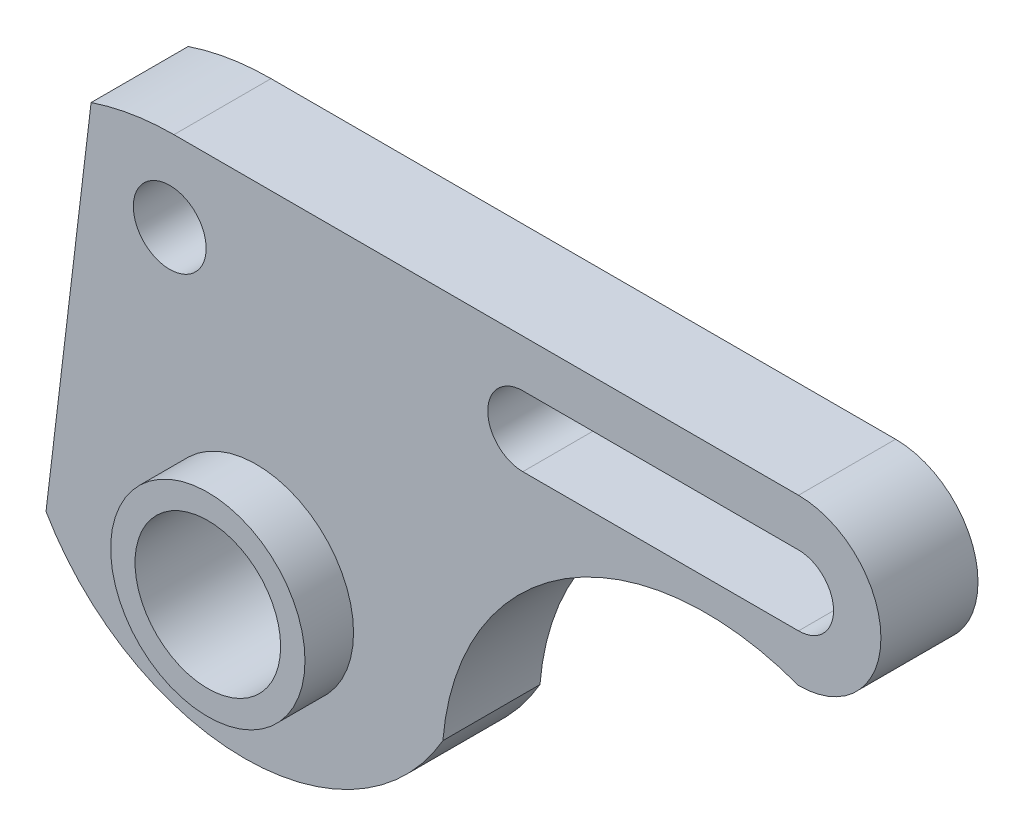
ISO-10303-21;
HEADER;
FILE_DESCRIPTION(('STEP AP214'),'2;1');
FILE_NAME('part.step','',(''),(''),'','','');
FILE_SCHEMA(('AUTOMOTIVE_DESIGN { 1 0 10303 214 1 1 1 1 }'));
ENDSEC;
DATA;
#1=APPLICATION_CONTEXT('core data for automotive mechanical design processes');
#2=APPLICATION_PROTOCOL_DEFINITION('international standard','automotive_design',2000,#1);
#3=PRODUCT_CONTEXT('',#1,'mechanical');
#4=PRODUCT('Part','Part','',(#3));
#5=PRODUCT_RELATED_PRODUCT_CATEGORY('part','',(#4));
#6=PRODUCT_DEFINITION_FORMATION('','',#4);
#7=PRODUCT_DEFINITION_CONTEXT('part definition',#1,'design');
#8=PRODUCT_DEFINITION('design','',#6,#7);
#9=PRODUCT_DEFINITION_SHAPE('','',#8);
#10=(LENGTH_UNIT() NAMED_UNIT(*) SI_UNIT(.MILLI.,.METRE.));
#11=(NAMED_UNIT(*) PLANE_ANGLE_UNIT() SI_UNIT($,.RADIAN.));
#12=(NAMED_UNIT(*) SI_UNIT($,.STERADIAN.) SOLID_ANGLE_UNIT());
#13=UNCERTAINTY_MEASURE_WITH_UNIT(LENGTH_MEASURE(1.E-05),#10,'distance_accuracy_value','');
#14=(GEOMETRIC_REPRESENTATION_CONTEXT(3) GLOBAL_UNCERTAINTY_ASSIGNED_CONTEXT((#13)) GLOBAL_UNIT_ASSIGNED_CONTEXT((#10,
#11,#12)) REPRESENTATION_CONTEXT('',''));
#15=CARTESIAN_POINT('',(0.,0.,0.));
#16=DIRECTION('',(0.,0.,1.));
#17=DIRECTION('',(1.,0.,0.));
#18=AXIS2_PLACEMENT_3D('',#15,#16,#17);
#19=CARTESIAN_POINT('',(-2.45741540152947,-1.40611469499279,20.));
#20=DIRECTION('',(0.,0.,-1.));
#21=DIRECTION('',(-1.,0.,0.));
#22=AXIS2_PLACEMENT_3D('',#19,#20,#21);
#23=CYLINDRICAL_SURFACE('',#22,47.2126677429411);
#24=CARTESIAN_POINT('',(-2.45741540152947,-1.40611469499279,0.));
#25=DIRECTION('',(0.,0.,1.));
#26=DIRECTION('',(1.,0.,0.));
#27=AXIS2_PLACEMENT_3D('',#24,#25,#26);
#28=CIRCLE('',#27,47.2126677429411);
#29=CARTESIAN_POINT('',(-43.3398716269745,-25.0209568155729,0.));
#30=VERTEX_POINT('',#29);
#31=CARTESIAN_POINT('',(38.4250408239156,-25.0209568155729,0.));
#32=VERTEX_POINT('',#31);
#33=EDGE_CURVE('E163',#30,#32,#28,.T.);
#34=ORIENTED_EDGE('',*,*,#33,.T.);
#35=DIRECTION('',(0.,0.,-1.));
#36=VECTOR('',#35,1.);
#37=CARTESIAN_POINT('',(38.4250408239156,-25.0209568155729,20.));
#38=LINE('',#37,#36);
#39=CARTESIAN_POINT('',(38.4250408239156,-25.0209568155729,20.));
#40=VERTEX_POINT('',#39);
#41=EDGE_CURVE('E11',#40,#32,#38,.T.);
#42=ORIENTED_EDGE('',*,*,#41,.F.);
#43=CARTESIAN_POINT('',(-2.45741540152947,-1.40611469499279,20.));
#44=DIRECTION('',(0.,0.,1.));
#45=DIRECTION('',(1.,0.,0.));
#46=AXIS2_PLACEMENT_3D('',#43,#44,#45);
#47=CIRCLE('',#46,47.2126677429411);
#48=CARTESIAN_POINT('',(-43.3398716269745,-25.0209568155729,20.));
#49=VERTEX_POINT('',#48);
#50=EDGE_CURVE('E177',#49,#40,#47,.T.);
#51=ORIENTED_EDGE('',*,*,#50,.F.);
#52=DIRECTION('',(0.,0.,-1.));
#53=VECTOR('',#52,1.);
#54=CARTESIAN_POINT('',(-43.3398716269745,-25.0209568155729,20.));
#55=LINE('',#54,#53);
#56=EDGE_CURVE('E197',#49,#30,#55,.T.);
#57=ORIENTED_EDGE('',*,*,#56,.T.);
#58=EDGE_LOOP('',(#34,#42,#51,#57));
#59=FACE_BOUND('',#58,.T.);
#60=ADVANCED_FACE('F39',(#59),#23,.T.);
#61=CARTESIAN_POINT('',(92.6692282730483,-29.5510831580167,20.));
#62=DIRECTION('',(0.,0.,-1.));
#63=DIRECTION('',(-1.,0.,0.));
#64=AXIS2_PLACEMENT_3D('',#61,#62,#63);
#65=CYLINDRICAL_SURFACE('',#64,54.4330222998425);
#66=CARTESIAN_POINT('',(92.6692282730483,-29.5510831580167,0.));
#67=DIRECTION('',(0.,0.,-1.));
#68=DIRECTION('',(-1.,0.,0.));
#69=AXIS2_PLACEMENT_3D('',#66,#67,#68);
#70=CIRCLE('',#69,54.4330222998425);
#71=CARTESIAN_POINT('',(111.700700069522,21.4465344133482,0.));
#72=VERTEX_POINT('',#71);
#73=EDGE_CURVE('E201',#32,#72,#70,.T.);
#74=ORIENTED_EDGE('',*,*,#73,.T.);
#75=DIRECTION('',(0.,0.,-1.));
#76=VECTOR('',#75,1.);
#77=CARTESIAN_POINT('',(111.700700069522,21.4465344133482,20.));
#78=LINE('',#77,#76);
#79=CARTESIAN_POINT('',(111.700700069522,21.4465344133482,20.));
#80=VERTEX_POINT('',#79);
#81=EDGE_CURVE('E47',#80,#72,#78,.T.);
#82=ORIENTED_EDGE('',*,*,#81,.F.);
#83=CARTESIAN_POINT('',(92.6692282730483,-29.5510831580167,20.));
#84=DIRECTION('',(0.,0.,-1.));
#85=DIRECTION('',(-1.,0.,0.));
#86=AXIS2_PLACEMENT_3D('',#83,#84,#85);
#87=CIRCLE('',#86,54.4330222998425);
#88=EDGE_CURVE('E181',#40,#80,#87,.T.);
#89=ORIENTED_EDGE('',*,*,#88,.F.);
#90=ORIENTED_EDGE('',*,*,#41,.T.);
#91=EDGE_LOOP('',(#74,#82,#89,#90));
#92=FACE_BOUND('',#91,.T.);
#93=ADVANCED_FACE('F257',(#92),#65,.F.);
#94=CARTESIAN_POINT('',(111.700700069522,38.4250408239155,20.));
#95=DIRECTION('',(0.,0.,-1.));
#96=DIRECTION('',(-1.,0.,0.));
#97=AXIS2_PLACEMENT_3D('',#94,#95,#96);
#98=CYLINDRICAL_SURFACE('',#97,16.9785064105673);
#99=CARTESIAN_POINT('',(111.700700069522,38.4250408239155,0.));
#100=DIRECTION('',(0.,0.,1.));
#101=DIRECTION('',(1.,0.,0.));
#102=AXIS2_PLACEMENT_3D('',#99,#100,#101);
#103=CIRCLE('',#102,16.9785064105673);
#104=CARTESIAN_POINT('',(111.700700069522,55.4035472344829,0.));
#105=VERTEX_POINT('',#104);
#106=EDGE_CURVE('E204',#72,#105,#103,.T.);
#107=ORIENTED_EDGE('',*,*,#106,.T.);
#108=DIRECTION('',(0.,0.,-1.));
#109=VECTOR('',#108,1.);
#110=CARTESIAN_POINT('',(111.700700069522,55.4035472344829,20.));
#111=LINE('',#110,#109);
#112=CARTESIAN_POINT('',(111.700700069522,55.4035472344829,20.));
#113=VERTEX_POINT('',#112);
#114=EDGE_CURVE('E226',#113,#105,#111,.T.);
#115=ORIENTED_EDGE('',*,*,#114,.F.);
#116=CARTESIAN_POINT('',(111.700700069522,38.4250408239155,20.));
#117=DIRECTION('',(0.,0.,1.));
#118=DIRECTION('',(1.,0.,0.));
#119=AXIS2_PLACEMENT_3D('',#116,#117,#118);
#120=CIRCLE('',#119,16.9785064105673);
#121=EDGE_CURVE('E185',#80,#113,#120,.T.);
#122=ORIENTED_EDGE('',*,*,#121,.F.);
#123=ORIENTED_EDGE('',*,*,#81,.T.);
#124=EDGE_LOOP('',(#107,#115,#122,#123));
#125=FACE_BOUND('',#124,.T.);
#126=ADVANCED_FACE('F235',(#125),#98,.T.);
#127=CARTESIAN_POINT('',(111.700700069522,55.4035472344829,20.));
#128=DIRECTION('',(0.,-1.,0.));
#129=DIRECTION('',(0.,0.,-1.));
#130=AXIS2_PLACEMENT_3D('',#127,#128,#129);
#131=PLANE('',#130);
#132=DIRECTION('',(-1.,0.,0.));
#133=VECTOR('',#132,1.);
#134=CARTESIAN_POINT('',(111.700700069522,55.4035472344829,0.));
#135=LINE('',#134,#133);
#136=CARTESIAN_POINT('',(-16.9785064105673,55.4035472344829,0.));
#137=VERTEX_POINT('',#136);
#138=EDGE_CURVE('E207',#105,#137,#135,.T.);
#139=ORIENTED_EDGE('',*,*,#138,.T.);
#140=DIRECTION('',(0.,0.,-1.));
#141=VECTOR('',#140,1.);
#142=CARTESIAN_POINT('',(-16.9785064105673,55.4035472344829,20.));
#143=LINE('',#142,#141);
#144=CARTESIAN_POINT('',(-16.9785064105673,55.4035472344829,20.));
#145=VERTEX_POINT('',#144);
#146=EDGE_CURVE('E222',#145,#137,#143,.T.);
#147=ORIENTED_EDGE('',*,*,#146,.F.);
#148=DIRECTION('',(-1.,0.,0.));
#149=VECTOR('',#148,1.);
#150=CARTESIAN_POINT('',(111.700700069522,55.4035472344829,20.));
#151=LINE('',#150,#149);
#152=EDGE_CURVE('E188',#113,#145,#151,.T.);
#153=ORIENTED_EDGE('',*,*,#152,.F.);
#154=ORIENTED_EDGE('',*,*,#114,.T.);
#155=EDGE_LOOP('',(#139,#147,#153,#154));
#156=FACE_BOUND('',#155,.T.);
#157=ADVANCED_FACE('F245',(#156),#131,.F.);
#158=CARTESIAN_POINT('',(-16.9785064105673,2.00057949585947,20.));
#159=DIRECTION('',(0.,0.,-1.));
#160=DIRECTION('',(-1.,0.,0.));
#161=AXIS2_PLACEMENT_3D('',#158,#159,#160);
#162=CYLINDRICAL_SURFACE('',#161,53.4029677386234);
#163=CARTESIAN_POINT('',(-16.9785064105673,2.00057949585947,0.));
#164=DIRECTION('',(0.,0.,1.));
#165=DIRECTION('',(1.,0.,0.));
#166=AXIS2_PLACEMENT_3D('',#163,#164,#165);
#167=CIRCLE('',#166,53.4029677386234);
#168=CARTESIAN_POINT('',(-34.0483396348929,52.6019407125912,0.));
#169=VERTEX_POINT('',#168);
#170=EDGE_CURVE('E210',#137,#169,#167,.T.);
#171=ORIENTED_EDGE('',*,*,#170,.T.);
#172=DIRECTION('',(0.,0.,-1.));
#173=VECTOR('',#172,1.);
#174=CARTESIAN_POINT('',(-34.0483396348929,52.6019407125912,20.));
#175=LINE('',#174,#173);
#176=CARTESIAN_POINT('',(-34.0483396348929,52.6019407125912,20.));
#177=VERTEX_POINT('',#176);
#178=EDGE_CURVE('E218',#177,#169,#175,.T.);
#179=ORIENTED_EDGE('',*,*,#178,.F.);
#180=CARTESIAN_POINT('',(-16.9785064105673,2.00057949585947,20.));
#181=DIRECTION('',(0.,0.,1.));
#182=DIRECTION('',(1.,0.,0.));
#183=AXIS2_PLACEMENT_3D('',#180,#181,#182);
#184=CIRCLE('',#183,53.4029677386234);
#185=EDGE_CURVE('E191',#145,#177,#184,.T.);
#186=ORIENTED_EDGE('',*,*,#185,.F.);
#187=ORIENTED_EDGE('',*,*,#146,.T.);
#188=EDGE_LOOP('',(#171,#179,#186,#187));
#189=FACE_BOUND('',#188,.T.);
#190=ADVANCED_FACE('F249',(#189),#162,.T.);
#191=CARTESIAN_POINT('',(-34.0483396348929,52.6019407125912,20.));
#192=DIRECTION('',(0.992911925064084,-0.118852467645966,0.));
#193=DIRECTION('',(0.118852467645966,0.992911925064084,0.));
#194=AXIS2_PLACEMENT_3D('',#191,#192,#193);
#195=PLANE('',#194);
#196=DIRECTION('',(-0.118852467645966,-0.992911925064084,0.));
#197=VECTOR('',#196,1.);
#198=CARTESIAN_POINT('',(-34.0483396348929,52.6019407125912,0.));
#199=LINE('',#198,#197);
#200=EDGE_CURVE('E182',#169,#30,#199,.T.);
#201=ORIENTED_EDGE('',*,*,#200,.T.);
#202=ORIENTED_EDGE('',*,*,#56,.F.);
#203=DIRECTION('',(-0.118852467645966,-0.992911925064084,0.));
#204=VECTOR('',#203,1.);
#205=CARTESIAN_POINT('',(-34.0483396348929,52.6019407125912,20.));
#206=LINE('',#205,#204);
#207=EDGE_CURVE('E194',#177,#49,#206,.T.);
#208=ORIENTED_EDGE('',*,*,#207,.F.);
#209=ORIENTED_EDGE('',*,*,#178,.T.);
#210=EDGE_LOOP('',(#201,#202,#208,#209));
#211=FACE_BOUND('',#210,.T.);
#212=ADVANCED_FACE('F260',(#211),#195,.F.);
#213=CARTESIAN_POINT('',(-2.45741540152947,-1.40611469499279,20.));
#214=DIRECTION('',(0.,0.,1.));
#215=DIRECTION('',(1.,0.,0.));
#216=AXIS2_PLACEMENT_3D('',#213,#214,#215);
#217=PLANE('',#216);
#218=CARTESIAN_POINT('',(0.,-14.9465834331478,20.));
#219=DIRECTION('',(0.,0.,1.));
#220=DIRECTION('',(1.,0.,0.));
#221=AXIS2_PLACEMENT_3D('',#218,#219,#220);
#222=CIRCLE('',#221,20.0219593157014);
#223=CARTESIAN_POINT('',(20.0219593157014,-14.9465834331478,20.));
#224=VERTEX_POINT('',#223);
#225=EDGE_CURVE('E144',#224,#224,#222,.T.);
#226=ORIENTED_EDGE('',*,*,#225,.F.);
#227=EDGE_LOOP('',(#226));
#228=FACE_BOUND('',#227,.T.);
#229=CARTESIAN_POINT('',(54.8956446475056,38.4250408239155,20.));
#230=DIRECTION('',(0.,0.,1.));
#231=DIRECTION('',(1.,0.,0.));
#232=AXIS2_PLACEMENT_3D('',#229,#230,#231);
#233=CIRCLE('',#232,7.21856024798372);
#234=CARTESIAN_POINT('',(54.8956446475056,45.6436010718992,20.));
#235=VERTEX_POINT('',#234);
#236=CARTESIAN_POINT('',(54.8956446475056,31.2064805759318,20.));
#237=VERTEX_POINT('',#236);
#238=EDGE_CURVE('E54',#235,#237,#233,.T.);
#239=ORIENTED_EDGE('',*,*,#238,.F.);
#240=DIRECTION('',(-1.,0.,0.));
#241=VECTOR('',#240,1.);
#242=CARTESIAN_POINT('',(54.8956446475056,45.6436010718992,20.));
#243=LINE('',#242,#241);
#244=CARTESIAN_POINT('',(111.700700069522,45.6436010718992,20.));
#245=VERTEX_POINT('',#244);
#246=EDGE_CURVE('E137',#245,#235,#243,.T.);
#247=ORIENTED_EDGE('',*,*,#246,.F.);
#248=CARTESIAN_POINT('',(111.700700069522,38.4250408239155,20.));
#249=DIRECTION('',(0.,0.,1.));
#250=DIRECTION('',(1.,0.,0.));
#251=AXIS2_PLACEMENT_3D('',#248,#249,#250);
#252=CIRCLE('',#251,7.21856024798372);
#253=CARTESIAN_POINT('',(111.700700069522,31.2064805759318,20.));
#254=VERTEX_POINT('',#253);
#255=EDGE_CURVE('E141',#254,#245,#252,.T.);
#256=ORIENTED_EDGE('',*,*,#255,.F.);
#257=DIRECTION('',(1.,0.,0.));
#258=VECTOR('',#257,1.);
#259=CARTESIAN_POINT('',(54.8956446475056,31.2064805759318,20.));
#260=LINE('',#259,#258);
#261=EDGE_CURVE('E153',#237,#254,#260,.T.);
#262=ORIENTED_EDGE('',*,*,#261,.F.);
#263=EDGE_LOOP('',(#239,#247,#256,#262));
#264=FACE_BOUND('',#263,.T.);
#265=CARTESIAN_POINT('',(-17.8489198171365,38.4250408239155,20.));
#266=DIRECTION('',(0.,0.,1.));
#267=DIRECTION('',(1.,0.,0.));
#268=AXIS2_PLACEMENT_3D('',#265,#266,#267);
#269=CIRCLE('',#268,7.5);
#270=CARTESIAN_POINT('',(-10.3489198171365,38.4250408239155,20.));
#271=VERTEX_POINT('',#270);
#272=EDGE_CURVE('E172',#271,#271,#269,.T.);
#273=ORIENTED_EDGE('',*,*,#272,.F.);
#274=EDGE_LOOP('',(#273));
#275=FACE_BOUND('',#274,.T.);
#276=ORIENTED_EDGE('',*,*,#50,.T.);
#277=ORIENTED_EDGE('',*,*,#88,.T.);
#278=ORIENTED_EDGE('',*,*,#121,.T.);
#279=ORIENTED_EDGE('',*,*,#152,.T.);
#280=ORIENTED_EDGE('',*,*,#185,.T.);
#281=ORIENTED_EDGE('',*,*,#207,.T.);
#282=EDGE_LOOP('',(#276,#277,#278,#279,#280,#281));
#283=FACE_BOUND('',#282,.T.);
#284=ADVANCED_FACE('F253',(#228,#264,#275,#283),#217,.T.);
#285=CARTESIAN_POINT('',(-2.45741540152947,-1.40611469499279,0.));
#286=DIRECTION('',(0.,0.,1.));
#287=DIRECTION('',(1.,0.,0.));
#288=AXIS2_PLACEMENT_3D('',#285,#286,#287);
#289=PLANE('',#288);
#290=CARTESIAN_POINT('',(0.,-14.9465834331478,0.));
#291=DIRECTION('',(0.,0.,1.));
#292=DIRECTION('',(1.,0.,0.));
#293=AXIS2_PLACEMENT_3D('',#290,#291,#292);
#294=CIRCLE('',#293,15.);
#295=CARTESIAN_POINT('',(15.,-14.9465834331478,0.));
#296=VERTEX_POINT('',#295);
#297=EDGE_CURVE('E392',#296,#296,#294,.T.);
#298=ORIENTED_EDGE('',*,*,#297,.T.);
#299=EDGE_LOOP('',(#298));
#300=FACE_BOUND('',#299,.T.);
#301=DIRECTION('',(-1.,0.,0.));
#302=VECTOR('',#301,1.);
#303=CARTESIAN_POINT('',(54.8956446475056,45.6436010718992,0.));
#304=LINE('',#303,#302);
#305=CARTESIAN_POINT('',(111.700700069522,45.6436010718992,0.));
#306=VERTEX_POINT('',#305);
#307=CARTESIAN_POINT('',(54.8956446475056,45.6436010718992,0.));
#308=VERTEX_POINT('',#307);
#309=EDGE_CURVE('E125',#306,#308,#304,.T.);
#310=ORIENTED_EDGE('',*,*,#309,.T.);
#311=CARTESIAN_POINT('',(54.8956446475056,38.4250408239155,0.));
#312=DIRECTION('',(0.,0.,1.));
#313=DIRECTION('',(1.,0.,0.));
#314=AXIS2_PLACEMENT_3D('',#311,#312,#313);
#315=CIRCLE('',#314,7.21856024798372);
#316=CARTESIAN_POINT('',(54.8956446475056,31.2064805759318,0.));
#317=VERTEX_POINT('',#316);
#318=EDGE_CURVE('E118',#308,#317,#315,.T.);
#319=ORIENTED_EDGE('',*,*,#318,.T.);
#320=DIRECTION('',(1.,0.,0.));
#321=VECTOR('',#320,1.);
#322=CARTESIAN_POINT('',(54.8956446475056,31.2064805759318,0.));
#323=LINE('',#322,#321);
#324=CARTESIAN_POINT('',(111.700700069522,31.2064805759318,0.));
#325=VERTEX_POINT('',#324);
#326=EDGE_CURVE('E128',#317,#325,#323,.T.);
#327=ORIENTED_EDGE('',*,*,#326,.T.);
#328=CARTESIAN_POINT('',(111.700700069522,38.4250408239155,0.));
#329=DIRECTION('',(0.,0.,1.));
#330=DIRECTION('',(1.,0.,0.));
#331=AXIS2_PLACEMENT_3D('',#328,#329,#330);
#332=CIRCLE('',#331,7.21856024798372);
#333=EDGE_CURVE('E62',#325,#306,#332,.T.);
#334=ORIENTED_EDGE('',*,*,#333,.T.);
#335=EDGE_LOOP('',(#310,#319,#327,#334));
#336=FACE_BOUND('',#335,.T.);
#337=CARTESIAN_POINT('',(-17.8489198171365,38.4250408239155,0.));
#338=DIRECTION('',(0.,0.,1.));
#339=DIRECTION('',(1.,0.,0.));
#340=AXIS2_PLACEMENT_3D('',#337,#338,#339);
#341=CIRCLE('',#340,7.5);
#342=CARTESIAN_POINT('',(-10.3489198171365,38.4250408239155,0.));
#343=VERTEX_POINT('',#342);
#344=EDGE_CURVE('E154',#343,#343,#341,.T.);
#345=ORIENTED_EDGE('',*,*,#344,.T.);
#346=EDGE_LOOP('',(#345));
#347=FACE_BOUND('',#346,.T.);
#348=ORIENTED_EDGE('',*,*,#33,.F.);
#349=ORIENTED_EDGE('',*,*,#200,.F.);
#350=ORIENTED_EDGE('',*,*,#170,.F.);
#351=ORIENTED_EDGE('',*,*,#138,.F.);
#352=ORIENTED_EDGE('',*,*,#106,.F.);
#353=ORIENTED_EDGE('',*,*,#73,.F.);
#354=EDGE_LOOP('',(#348,#349,#350,#351,#352,#353));
#355=FACE_BOUND('',#354,.T.);
#356=ADVANCED_FACE('F133',(#300,#336,#347,#355),#289,.F.);
#357=CARTESIAN_POINT('',(-17.8489198171365,38.4250408239155,0.));
#358=DIRECTION('',(0.,0.,1.));
#359=DIRECTION('',(1.,0.,0.));
#360=AXIS2_PLACEMENT_3D('',#357,#358,#359);
#361=CYLINDRICAL_SURFACE('',#360,7.5);
#362=ORIENTED_EDGE('',*,*,#344,.F.);
#363=EDGE_LOOP('',(#362));
#364=FACE_BOUND('',#363,.T.);
#365=ORIENTED_EDGE('',*,*,#272,.T.);
#366=EDGE_LOOP('',(#365));
#367=FACE_BOUND('',#366,.T.);
#368=ADVANCED_FACE('F299',(#364,#367),#361,.F.);
#369=CARTESIAN_POINT('',(54.8956446475056,38.4250408239155,0.));
#370=DIRECTION('',(0.,0.,1.));
#371=DIRECTION('',(1.,0.,0.));
#372=AXIS2_PLACEMENT_3D('',#369,#370,#371);
#373=CYLINDRICAL_SURFACE('',#372,7.21856024798372);
#374=ORIENTED_EDGE('',*,*,#238,.T.);
#375=DIRECTION('',(0.,0.,1.));
#376=VECTOR('',#375,1.);
#377=CARTESIAN_POINT('',(54.8956446475056,31.2064805759318,0.));
#378=LINE('',#377,#376);
#379=EDGE_CURVE('E114',#317,#237,#378,.T.);
#380=ORIENTED_EDGE('',*,*,#379,.F.);
#381=ORIENTED_EDGE('',*,*,#318,.F.);
#382=DIRECTION('',(0.,0.,1.));
#383=VECTOR('',#382,1.);
#384=CARTESIAN_POINT('',(54.8956446475056,45.6436010718992,0.));
#385=LINE('',#384,#383);
#386=EDGE_CURVE('E160',#308,#235,#385,.T.);
#387=ORIENTED_EDGE('',*,*,#386,.T.);
#388=EDGE_LOOP('',(#374,#380,#381,#387));
#389=FACE_BOUND('',#388,.T.);
#390=ADVANCED_FACE('F116',(#389),#373,.F.);
#391=CARTESIAN_POINT('',(54.8956446475056,45.6436010718992,0.));
#392=DIRECTION('',(0.,1.,0.));
#393=DIRECTION('',(0.,0.,1.));
#394=AXIS2_PLACEMENT_3D('',#391,#392,#393);
#395=PLANE('',#394);
#396=ORIENTED_EDGE('',*,*,#246,.T.);
#397=ORIENTED_EDGE('',*,*,#386,.F.);
#398=ORIENTED_EDGE('',*,*,#309,.F.);
#399=DIRECTION('',(0.,0.,1.));
#400=VECTOR('',#399,1.);
#401=CARTESIAN_POINT('',(111.700700069522,45.6436010718992,0.));
#402=LINE('',#401,#400);
#403=EDGE_CURVE('E164',#306,#245,#402,.T.);
#404=ORIENTED_EDGE('',*,*,#403,.T.);
#405=EDGE_LOOP('',(#396,#397,#398,#404));
#406=FACE_BOUND('',#405,.T.);
#407=ADVANCED_FACE('F315',(#406),#395,.F.);
#408=CARTESIAN_POINT('',(111.700700069522,38.4250408239155,0.));
#409=DIRECTION('',(0.,0.,1.));
#410=DIRECTION('',(1.,0.,0.));
#411=AXIS2_PLACEMENT_3D('',#408,#409,#410);
#412=CYLINDRICAL_SURFACE('',#411,7.21856024798372);
#413=ORIENTED_EDGE('',*,*,#255,.T.);
#414=ORIENTED_EDGE('',*,*,#403,.F.);
#415=ORIENTED_EDGE('',*,*,#333,.F.);
#416=DIRECTION('',(0.,0.,1.));
#417=VECTOR('',#416,1.);
#418=CARTESIAN_POINT('',(111.700700069522,31.2064805759318,0.));
#419=LINE('',#418,#417);
#420=EDGE_CURVE('E124',#325,#254,#419,.T.);
#421=ORIENTED_EDGE('',*,*,#420,.T.);
#422=EDGE_LOOP('',(#413,#414,#415,#421));
#423=FACE_BOUND('',#422,.T.);
#424=ADVANCED_FACE('F324',(#423),#412,.F.);
#425=CARTESIAN_POINT('',(54.8956446475056,31.2064805759318,0.));
#426=DIRECTION('',(0.,-1.,0.));
#427=DIRECTION('',(0.,0.,-1.));
#428=AXIS2_PLACEMENT_3D('',#425,#426,#427);
#429=PLANE('',#428);
#430=ORIENTED_EDGE('',*,*,#261,.T.);
#431=ORIENTED_EDGE('',*,*,#420,.F.);
#432=ORIENTED_EDGE('',*,*,#326,.F.);
#433=ORIENTED_EDGE('',*,*,#379,.T.);
#434=EDGE_LOOP('',(#430,#431,#432,#433));
#435=FACE_BOUND('',#434,.T.);
#436=ADVANCED_FACE('F129',(#435),#429,.F.);
#437=CARTESIAN_POINT('',(0.,-14.9465834331478,30.));
#438=DIRECTION('',(0.,0.,-1.));
#439=DIRECTION('',(-1.,0.,0.));
#440=AXIS2_PLACEMENT_3D('',#437,#438,#439);
#441=CYLINDRICAL_SURFACE('',#440,20.0219593157014);
#442=CARTESIAN_POINT('',(0.,-14.9465834331478,30.));
#443=DIRECTION('',(0.,0.,1.));
#444=DIRECTION('',(1.,0.,0.));
#445=AXIS2_PLACEMENT_3D('',#442,#443,#444);
#446=CIRCLE('',#445,20.0219593157014);
#447=CARTESIAN_POINT('',(20.0219593157014,-14.9465834331478,30.));
#448=VERTEX_POINT('',#447);
#449=EDGE_CURVE('E176',#448,#448,#446,.T.);
#450=ORIENTED_EDGE('',*,*,#449,.F.);
#451=EDGE_LOOP('',(#450));
#452=FACE_BOUND('',#451,.T.);
#453=ORIENTED_EDGE('',*,*,#225,.T.);
#454=EDGE_LOOP('',(#453));
#455=FACE_BOUND('',#454,.T.);
#456=ADVANCED_FACE('F342',(#452,#455),#441,.T.);
#457=CARTESIAN_POINT('',(0.,-14.9465834331478,30.));
#458=DIRECTION('',(0.,0.,1.));
#459=DIRECTION('',(1.,0.,0.));
#460=AXIS2_PLACEMENT_3D('',#457,#458,#459);
#461=PLANE('',#460);
#462=CARTESIAN_POINT('',(0.,-14.9465834331478,30.));
#463=DIRECTION('',(0.,0.,1.));
#464=DIRECTION('',(1.,0.,0.));
#465=AXIS2_PLACEMENT_3D('',#462,#463,#464);
#466=CIRCLE('',#465,15.);
#467=CARTESIAN_POINT('',(15.,-14.9465834331478,30.));
#468=VERTEX_POINT('',#467);
#469=EDGE_CURVE('E389',#468,#468,#466,.T.);
#470=ORIENTED_EDGE('',*,*,#469,.F.);
#471=EDGE_LOOP('',(#470));
#472=FACE_BOUND('',#471,.T.);
#473=ORIENTED_EDGE('',*,*,#449,.T.);
#474=EDGE_LOOP('',(#473));
#475=FACE_BOUND('',#474,.T.);
#476=ADVANCED_FACE('F356',(#472,#475),#461,.T.);
#477=CARTESIAN_POINT('',(0.,-14.9465834331478,-10.));
#478=DIRECTION('',(0.,0.,1.));
#479=DIRECTION('',(1.,0.,0.));
#480=AXIS2_PLACEMENT_3D('',#477,#478,#479);
#481=CYLINDRICAL_SURFACE('',#480,15.);
#482=ORIENTED_EDGE('',*,*,#469,.T.);
#483=EDGE_LOOP('',(#482));
#484=FACE_BOUND('',#483,.T.);
#485=ORIENTED_EDGE('',*,*,#297,.F.);
#486=EDGE_LOOP('',(#485));
#487=FACE_BOUND('',#486,.T.);
#488=ADVANCED_FACE('F372',(#484,#487),#481,.F.);
#489=CLOSED_SHELL('',(#60,#93,#126,#157,#190,#212,#284,#356,#368,#390,#407,#424,#436,#456,#476,#488));
#490=MANIFOLD_SOLID_BREP('B2',#489);
#491=ADVANCED_BREP_SHAPE_REPRESENTATION('',(#18,#490),#14);
#492=SHAPE_DEFINITION_REPRESENTATION(#9,#491);
ENDSEC;
END-ISO-10303-21;
